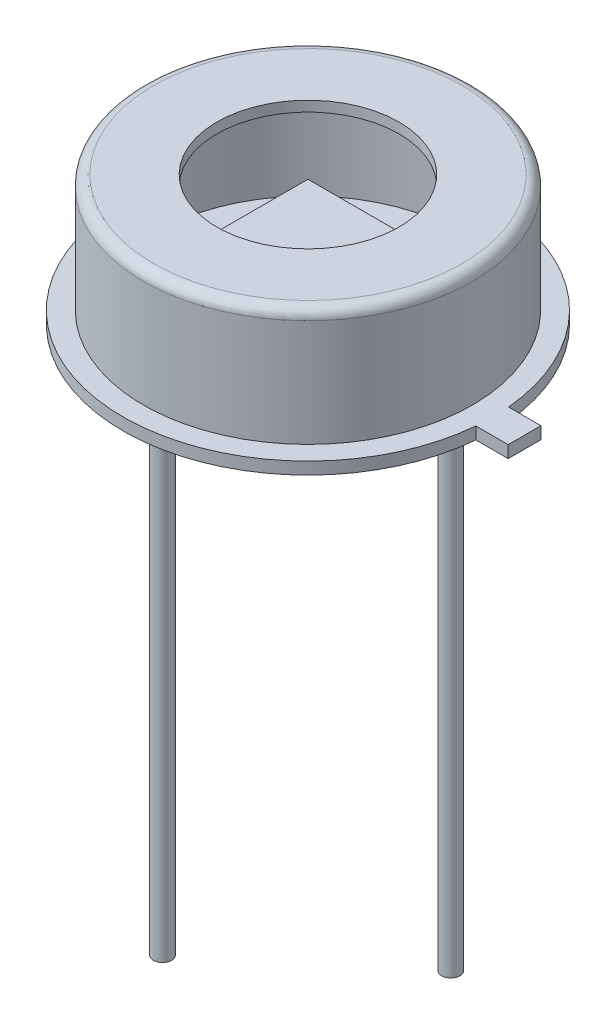
ISO-10303-21;
HEADER;
FILE_DESCRIPTION(('STEP AP214'),'2;1');
FILE_NAME('part.step','',(''),(''),'','','');
FILE_SCHEMA(('AUTOMOTIVE_DESIGN { 1 0 10303 214 1 1 1 1 }'));
ENDSEC;
DATA;
#1=APPLICATION_CONTEXT('core data for automotive mechanical design processes');
#2=APPLICATION_PROTOCOL_DEFINITION('international standard','automotive_design',2000,#1);
#3=PRODUCT_CONTEXT('',#1,'mechanical');
#4=PRODUCT('Part','Part','',(#3));
#5=PRODUCT_RELATED_PRODUCT_CATEGORY('part','',(#4));
#6=PRODUCT_DEFINITION_FORMATION('','',#4);
#7=PRODUCT_DEFINITION_CONTEXT('part definition',#1,'design');
#8=PRODUCT_DEFINITION('design','',#6,#7);
#9=PRODUCT_DEFINITION_SHAPE('','',#8);
#10=(LENGTH_UNIT() NAMED_UNIT(*) SI_UNIT(.MILLI.,.METRE.));
#11=(NAMED_UNIT(*) PLANE_ANGLE_UNIT() SI_UNIT($,.RADIAN.));
#12=(NAMED_UNIT(*) SI_UNIT($,.STERADIAN.) SOLID_ANGLE_UNIT());
#13=UNCERTAINTY_MEASURE_WITH_UNIT(LENGTH_MEASURE(1.E-05),#10,'distance_accuracy_value','');
#14=(GEOMETRIC_REPRESENTATION_CONTEXT(3) GLOBAL_UNCERTAINTY_ASSIGNED_CONTEXT((#13)) GLOBAL_UNIT_ASSIGNED_CONTEXT((#10,
#11,#12)) REPRESENTATION_CONTEXT('',''));
#15=CARTESIAN_POINT('',(0.,0.,0.));
#16=DIRECTION('',(0.,0.,1.));
#17=DIRECTION('',(1.,0.,0.));
#18=AXIS2_PLACEMENT_3D('',#15,#16,#17);
#19=CARTESIAN_POINT('',(-1.25,1.8,-1.25));
#20=DIRECTION('',(0.,-1.,0.));
#21=DIRECTION('',(0.,0.,-1.));
#22=AXIS2_PLACEMENT_3D('',#19,#20,#21);
#23=PLANE('',#22);
#24=DIRECTION('',(0.,0.,-1.));
#25=VECTOR('',#24,1.);
#26=CARTESIAN_POINT('',(-1.25,1.8,1.25));
#27=LINE('',#26,#25);
#28=CARTESIAN_POINT('',(-1.25,1.8,1.25));
#29=VERTEX_POINT('',#28);
#30=CARTESIAN_POINT('',(-1.25,1.8,-1.25));
#31=VERTEX_POINT('',#30);
#32=EDGE_CURVE('E139',#29,#31,#27,.T.);
#33=ORIENTED_EDGE('',*,*,#32,.F.);
#34=DIRECTION('',(-1.,0.,0.));
#35=VECTOR('',#34,1.);
#36=CARTESIAN_POINT('',(-1.25,1.8,1.25));
#37=LINE('',#36,#35);
#38=CARTESIAN_POINT('',(1.25,1.8,1.25));
#39=VERTEX_POINT('',#38);
#40=EDGE_CURVE('E152',#39,#29,#37,.T.);
#41=ORIENTED_EDGE('',*,*,#40,.F.);
#42=DIRECTION('',(0.,0.,1.));
#43=VECTOR('',#42,1.);
#44=CARTESIAN_POINT('',(1.25,1.8,1.25));
#45=LINE('',#44,#43);
#46=CARTESIAN_POINT('',(1.25,1.8,-1.25));
#47=VERTEX_POINT('',#46);
#48=EDGE_CURVE('E160',#47,#39,#45,.T.);
#49=ORIENTED_EDGE('',*,*,#48,.F.);
#50=DIRECTION('',(1.,0.,0.));
#51=VECTOR('',#50,1.);
#52=CARTESIAN_POINT('',(-1.25,1.8,-1.25));
#53=LINE('',#52,#51);
#54=EDGE_CURVE('E142',#31,#47,#53,.T.);
#55=ORIENTED_EDGE('',*,*,#54,.F.);
#56=EDGE_LOOP('',(#33,#41,#49,#55));
#57=FACE_BOUND('',#56,.T.);
#58=DIRECTION('',(0.,0.,1.));
#59=VECTOR('',#58,1.);
#60=CARTESIAN_POINT('',(-1.1,1.8,1.1));
#61=LINE('',#60,#59);
#62=CARTESIAN_POINT('',(-1.1,1.8,-1.1));
#63=VERTEX_POINT('',#62);
#64=CARTESIAN_POINT('',(-1.1,1.8,1.1));
#65=VERTEX_POINT('',#64);
#66=EDGE_CURVE('E138',#63,#65,#61,.T.);
#67=ORIENTED_EDGE('',*,*,#66,.F.);
#68=DIRECTION('',(-1.,0.,0.));
#69=VECTOR('',#68,1.);
#70=CARTESIAN_POINT('',(1.1,1.8,-1.1));
#71=LINE('',#70,#69);
#72=CARTESIAN_POINT('',(1.1,1.8,-1.1));
#73=VERTEX_POINT('',#72);
#74=EDGE_CURVE('E135',#73,#63,#71,.T.);
#75=ORIENTED_EDGE('',*,*,#74,.F.);
#76=DIRECTION('',(0.,0.,-1.));
#77=VECTOR('',#76,1.);
#78=CARTESIAN_POINT('',(1.1,1.8,1.1));
#79=LINE('',#78,#77);
#80=CARTESIAN_POINT('',(1.1,1.8,1.1));
#81=VERTEX_POINT('',#80);
#82=EDGE_CURVE('E73',#81,#73,#79,.T.);
#83=ORIENTED_EDGE('',*,*,#82,.F.);
#84=DIRECTION('',(1.,0.,0.));
#85=VECTOR('',#84,1.);
#86=CARTESIAN_POINT('',(1.1,1.8,1.1));
#87=LINE('',#86,#85);
#88=EDGE_CURVE('E68',#65,#81,#87,.T.);
#89=ORIENTED_EDGE('',*,*,#88,.F.);
#90=EDGE_LOOP('',(#67,#75,#83,#89));
#91=FACE_BOUND('',#90,.T.);
#92=ADVANCED_FACE('F53',(#57,#91),#23,.F.);
#93=CARTESIAN_POINT('',(-1.25,1.75,1.25));
#94=DIRECTION('',(1.,0.,0.));
#95=DIRECTION('',(0.,0.,-1.));
#96=AXIS2_PLACEMENT_3D('',#93,#94,#95);
#97=PLANE('',#96);
#98=ORIENTED_EDGE('',*,*,#32,.T.);
#99=DIRECTION('',(0.,1.,0.));
#100=VECTOR('',#99,1.);
#101=CARTESIAN_POINT('',(-1.25,1.75,-1.25));
#102=LINE('',#101,#100);
#103=CARTESIAN_POINT('',(-1.25,1.75,-1.25));
#104=VERTEX_POINT('',#103);
#105=EDGE_CURVE('E12',#104,#31,#102,.T.);
#106=ORIENTED_EDGE('',*,*,#105,.F.);
#107=DIRECTION('',(0.,0.,-1.));
#108=VECTOR('',#107,1.);
#109=CARTESIAN_POINT('',(-1.25,1.75,1.25));
#110=LINE('',#109,#108);
#111=CARTESIAN_POINT('',(-1.25,1.75,1.25));
#112=VERTEX_POINT('',#111);
#113=EDGE_CURVE('E148',#112,#104,#110,.T.);
#114=ORIENTED_EDGE('',*,*,#113,.F.);
#115=DIRECTION('',(0.,1.,0.));
#116=VECTOR('',#115,1.);
#117=CARTESIAN_POINT('',(-1.25,1.75,1.25));
#118=LINE('',#117,#116);
#119=EDGE_CURVE('E157',#112,#29,#118,.T.);
#120=ORIENTED_EDGE('',*,*,#119,.T.);
#121=EDGE_LOOP('',(#98,#106,#114,#120));
#122=FACE_BOUND('',#121,.T.);
#123=ADVANCED_FACE('F55',(#122),#97,.F.);
#124=CARTESIAN_POINT('',(-1.25,1.75,-1.25));
#125=DIRECTION('',(0.,0.,1.));
#126=DIRECTION('',(1.,0.,0.));
#127=AXIS2_PLACEMENT_3D('',#124,#125,#126);
#128=PLANE('',#127);
#129=ORIENTED_EDGE('',*,*,#54,.T.);
#130=DIRECTION('',(0.,1.,0.));
#131=VECTOR('',#130,1.);
#132=CARTESIAN_POINT('',(1.25,1.75,-1.25));
#133=LINE('',#132,#131);
#134=CARTESIAN_POINT('',(1.25,1.75,-1.25));
#135=VERTEX_POINT('',#134);
#136=EDGE_CURVE('E61',#135,#47,#133,.T.);
#137=ORIENTED_EDGE('',*,*,#136,.F.);
#138=DIRECTION('',(1.,0.,0.));
#139=VECTOR('',#138,1.);
#140=CARTESIAN_POINT('',(-1.25,1.75,-1.25));
#141=LINE('',#140,#139);
#142=EDGE_CURVE('E151',#104,#135,#141,.T.);
#143=ORIENTED_EDGE('',*,*,#142,.F.);
#144=ORIENTED_EDGE('',*,*,#105,.T.);
#145=EDGE_LOOP('',(#129,#137,#143,#144));
#146=FACE_BOUND('',#145,.T.);
#147=ADVANCED_FACE('F187',(#146),#128,.F.);
#148=CARTESIAN_POINT('',(1.25,1.75,1.25));
#149=DIRECTION('',(-1.,0.,0.));
#150=DIRECTION('',(0.,0.,1.));
#151=AXIS2_PLACEMENT_3D('',#148,#149,#150);
#152=PLANE('',#151);
#153=ORIENTED_EDGE('',*,*,#48,.T.);
#154=DIRECTION('',(0.,1.,0.));
#155=VECTOR('',#154,1.);
#156=CARTESIAN_POINT('',(1.25,1.75,1.25));
#157=LINE('',#156,#155);
#158=CARTESIAN_POINT('',(1.25,1.75,1.25));
#159=VERTEX_POINT('',#158);
#160=EDGE_CURVE('E165',#159,#39,#157,.T.);
#161=ORIENTED_EDGE('',*,*,#160,.F.);
#162=DIRECTION('',(0.,0.,1.));
#163=VECTOR('',#162,1.);
#164=CARTESIAN_POINT('',(1.25,1.75,1.25));
#165=LINE('',#164,#163);
#166=EDGE_CURVE('E154',#135,#159,#165,.T.);
#167=ORIENTED_EDGE('',*,*,#166,.F.);
#168=ORIENTED_EDGE('',*,*,#136,.T.);
#169=EDGE_LOOP('',(#153,#161,#167,#168));
#170=FACE_BOUND('',#169,.T.);
#171=ADVANCED_FACE('F172',(#170),#152,.F.);
#172=CARTESIAN_POINT('',(-1.25,1.75,1.25));
#173=DIRECTION('',(0.,0.,-1.));
#174=DIRECTION('',(-1.,0.,0.));
#175=AXIS2_PLACEMENT_3D('',#172,#173,#174);
#176=PLANE('',#175);
#177=ORIENTED_EDGE('',*,*,#40,.T.);
#178=ORIENTED_EDGE('',*,*,#119,.F.);
#179=DIRECTION('',(-1.,0.,0.));
#180=VECTOR('',#179,1.);
#181=CARTESIAN_POINT('',(-1.25,1.75,1.25));
#182=LINE('',#181,#180);
#183=EDGE_CURVE('E156',#159,#112,#182,.T.);
#184=ORIENTED_EDGE('',*,*,#183,.F.);
#185=ORIENTED_EDGE('',*,*,#160,.T.);
#186=EDGE_LOOP('',(#177,#178,#184,#185));
#187=FACE_BOUND('',#186,.T.);
#188=ADVANCED_FACE('F180',(#187),#176,.F.);
#189=CARTESIAN_POINT('',(-1.25,1.75,-1.25));
#190=DIRECTION('',(0.,-1.,0.));
#191=DIRECTION('',(0.,0.,-1.));
#192=AXIS2_PLACEMENT_3D('',#189,#190,#191);
#193=PLANE('',#192);
#194=ORIENTED_EDGE('',*,*,#113,.T.);
#195=ORIENTED_EDGE('',*,*,#142,.T.);
#196=ORIENTED_EDGE('',*,*,#166,.T.);
#197=ORIENTED_EDGE('',*,*,#183,.T.);
#198=EDGE_LOOP('',(#194,#195,#196,#197));
#199=FACE_BOUND('',#198,.T.);
#200=ADVANCED_FACE('F186',(#199),#193,.T.);
#201=CARTESIAN_POINT('',(-1.1,2.,1.1));
#202=DIRECTION('',(1.,0.,0.));
#203=DIRECTION('',(0.,0.,-1.));
#204=AXIS2_PLACEMENT_3D('',#201,#202,#203);
#205=PLANE('',#204);
#206=ORIENTED_EDGE('',*,*,#66,.T.);
#207=DIRECTION('',(0.,-1.,0.));
#208=VECTOR('',#207,1.);
#209=CARTESIAN_POINT('',(-1.1,2.,1.1));
#210=LINE('',#209,#208);
#211=CARTESIAN_POINT('',(-1.1,2.,1.1));
#212=VERTEX_POINT('',#211);
#213=EDGE_CURVE('E119',#212,#65,#210,.T.);
#214=ORIENTED_EDGE('',*,*,#213,.F.);
#215=DIRECTION('',(0.,0.,1.));
#216=VECTOR('',#215,1.);
#217=CARTESIAN_POINT('',(-1.1,2.,1.1));
#218=LINE('',#217,#216);
#219=CARTESIAN_POINT('',(-1.1,2.,-1.1));
#220=VERTEX_POINT('',#219);
#221=EDGE_CURVE('E126',#220,#212,#218,.T.);
#222=ORIENTED_EDGE('',*,*,#221,.F.);
#223=DIRECTION('',(0.,-1.,0.));
#224=VECTOR('',#223,1.);
#225=CARTESIAN_POINT('',(-1.1,2.,-1.1));
#226=LINE('',#225,#224);
#227=EDGE_CURVE('E282',#220,#63,#226,.T.);
#228=ORIENTED_EDGE('',*,*,#227,.T.);
#229=EDGE_LOOP('',(#206,#214,#222,#228));
#230=FACE_BOUND('',#229,.T.);
#231=ADVANCED_FACE('F137',(#230),#205,.F.);
#232=CARTESIAN_POINT('',(1.1,2.,1.1));
#233=DIRECTION('',(0.,0.,-1.));
#234=DIRECTION('',(-1.,0.,0.));
#235=AXIS2_PLACEMENT_3D('',#232,#233,#234);
#236=PLANE('',#235);
#237=ORIENTED_EDGE('',*,*,#88,.T.);
#238=DIRECTION('',(0.,-1.,0.));
#239=VECTOR('',#238,1.);
#240=CARTESIAN_POINT('',(1.1,2.,1.1));
#241=LINE('',#240,#239);
#242=CARTESIAN_POINT('',(1.1,2.,1.1));
#243=VERTEX_POINT('',#242);
#244=EDGE_CURVE('E122',#243,#81,#241,.T.);
#245=ORIENTED_EDGE('',*,*,#244,.F.);
#246=DIRECTION('',(1.,0.,0.));
#247=VECTOR('',#246,1.);
#248=CARTESIAN_POINT('',(1.1,2.,1.1));
#249=LINE('',#248,#247);
#250=EDGE_CURVE('E115',#212,#243,#249,.T.);
#251=ORIENTED_EDGE('',*,*,#250,.F.);
#252=ORIENTED_EDGE('',*,*,#213,.T.);
#253=EDGE_LOOP('',(#237,#245,#251,#252));
#254=FACE_BOUND('',#253,.T.);
#255=ADVANCED_FACE('F117',(#254),#236,.F.);
#256=CARTESIAN_POINT('',(1.1,2.,1.1));
#257=DIRECTION('',(-1.,0.,0.));
#258=DIRECTION('',(0.,0.,1.));
#259=AXIS2_PLACEMENT_3D('',#256,#257,#258);
#260=PLANE('',#259);
#261=ORIENTED_EDGE('',*,*,#82,.T.);
#262=DIRECTION('',(0.,-1.,0.));
#263=VECTOR('',#262,1.);
#264=CARTESIAN_POINT('',(1.1,2.,-1.1));
#265=LINE('',#264,#263);
#266=CARTESIAN_POINT('',(1.1,2.,-1.1));
#267=VERTEX_POINT('',#266);
#268=EDGE_CURVE('E144',#267,#73,#265,.T.);
#269=ORIENTED_EDGE('',*,*,#268,.F.);
#270=DIRECTION('',(0.,0.,-1.));
#271=VECTOR('',#270,1.);
#272=CARTESIAN_POINT('',(1.1,2.,1.1));
#273=LINE('',#272,#271);
#274=EDGE_CURVE('E125',#243,#267,#273,.T.);
#275=ORIENTED_EDGE('',*,*,#274,.F.);
#276=ORIENTED_EDGE('',*,*,#244,.T.);
#277=EDGE_LOOP('',(#261,#269,#275,#276));
#278=FACE_BOUND('',#277,.T.);
#279=ADVANCED_FACE('F211',(#278),#260,.F.);
#280=CARTESIAN_POINT('',(1.1,2.,-1.1));
#281=DIRECTION('',(0.,0.,1.));
#282=DIRECTION('',(1.,0.,0.));
#283=AXIS2_PLACEMENT_3D('',#280,#281,#282);
#284=PLANE('',#283);
#285=ORIENTED_EDGE('',*,*,#74,.T.);
#286=ORIENTED_EDGE('',*,*,#227,.F.);
#287=DIRECTION('',(-1.,0.,0.));
#288=VECTOR('',#287,1.);
#289=CARTESIAN_POINT('',(1.1,2.,-1.1));
#290=LINE('',#289,#288);
#291=EDGE_CURVE('E131',#267,#220,#290,.T.);
#292=ORIENTED_EDGE('',*,*,#291,.F.);
#293=ORIENTED_EDGE('',*,*,#268,.T.);
#294=EDGE_LOOP('',(#285,#286,#292,#293));
#295=FACE_BOUND('',#294,.T.);
#296=ADVANCED_FACE('F216',(#295),#284,.F.);
#297=CARTESIAN_POINT('',(-1.1,2.,-1.1));
#298=DIRECTION('',(0.,1.,0.));
#299=DIRECTION('',(0.,0.,1.));
#300=AXIS2_PLACEMENT_3D('',#297,#298,#299);
#301=PLANE('',#300);
#302=ORIENTED_EDGE('',*,*,#221,.T.);
#303=ORIENTED_EDGE('',*,*,#250,.T.);
#304=ORIENTED_EDGE('',*,*,#274,.T.);
#305=ORIENTED_EDGE('',*,*,#291,.T.);
#306=EDGE_LOOP('',(#302,#303,#304,#305));
#307=FACE_BOUND('',#306,.T.);
#308=ADVANCED_FACE('F129',(#307),#301,.T.);
#309=CLOSED_SHELL('',(#92,#123,#147,#171,#188,#200,#231,#255,#279,#296,#308));
#310=MANIFOLD_SOLID_BREP('B2',#309);
#311=CARTESIAN_POINT('',(4.57,0.,0.));
#312=DIRECTION('',(0.,1.,0.));
#313=DIRECTION('',(0.,0.,1.));
#314=AXIS2_PLACEMENT_3D('',#311,#312,#313);
#315=PLANE('',#314);
#316=CARTESIAN_POINT('',(2.09605122421386,0.,-1.43463210108781));
#317=DIRECTION('',(0.,1.,0.));
#318=DIRECTION('',(0.,0.,1.));
#319=AXIS2_PLACEMENT_3D('',#316,#317,#318);
#320=CIRCLE('',#319,0.225000000000001);
#321=CARTESIAN_POINT('',(2.09605122421386,0.,-1.20963210108781));
#322=VERTEX_POINT('',#321);
#323=EDGE_CURVE('E308',#322,#322,#320,.F.);
#324=ORIENTED_EDGE('',*,*,#323,.F.);
#325=EDGE_LOOP('',(#324));
#326=FACE_BOUND('',#325,.T.);
#327=CARTESIAN_POINT('',(0.,0.,0.));
#328=DIRECTION('',(0.,-1.,0.));
#329=DIRECTION('',(0.,0.,-1.));
#330=AXIS2_PLACEMENT_3D('',#327,#328,#329);
#331=CIRCLE('',#330,4.57);
#332=CARTESIAN_POINT('',(4.55201878291379,0.,0.405000000000049));
#333=VERTEX_POINT('',#332);
#334=CARTESIAN_POINT('',(4.5520187829138,0.,-0.404999999999951));
#335=VERTEX_POINT('',#334);
#336=EDGE_CURVE('E315',#333,#335,#331,.T.);
#337=ORIENTED_EDGE('',*,*,#336,.T.);
#338=DIRECTION('',(-1.,0.,0.));
#339=VECTOR('',#338,1.);
#340=CARTESIAN_POINT('',(0.,0.,-0.405));
#341=LINE('',#340,#339);
#342=CARTESIAN_POINT('',(5.3520187829138,0.,-0.404999999999943));
#343=VERTEX_POINT('',#342);
#344=EDGE_CURVE('E365',#343,#335,#341,.T.);
#345=ORIENTED_EDGE('',*,*,#344,.F.);
#346=DIRECTION('',(0.,0.,1.));
#347=VECTOR('',#346,1.);
#348=CARTESIAN_POINT('',(5.3520187829138,0.,0.));
#349=LINE('',#348,#347);
#350=CARTESIAN_POINT('',(5.35201878291379,0.,0.405000000000057));
#351=VERTEX_POINT('',#350);
#352=EDGE_CURVE('E359',#343,#351,#349,.T.);
#353=ORIENTED_EDGE('',*,*,#352,.T.);
#354=DIRECTION('',(-1.,0.,0.));
#355=VECTOR('',#354,1.);
#356=CARTESIAN_POINT('',(0.,0.,0.405));
#357=LINE('',#356,#355);
#358=EDGE_CURVE('E357',#351,#333,#357,.T.);
#359=ORIENTED_EDGE('',*,*,#358,.T.);
#360=EDGE_LOOP('',(#337,#345,#353,#359));
#361=FACE_BOUND('',#360,.T.);
#362=CARTESIAN_POINT('',(-1.79605122421384,0.,1.79605122421382));
#363=DIRECTION('',(0.,1.,0.));
#364=DIRECTION('',(0.,0.,1.));
#365=AXIS2_PLACEMENT_3D('',#362,#363,#364);
#366=CIRCLE('',#365,0.225000000000001);
#367=CARTESIAN_POINT('',(-1.79605122421384,0.,2.02105122421382));
#368=VERTEX_POINT('',#367);
#369=EDGE_CURVE('E51',#368,#368,#366,.F.);
#370=ORIENTED_EDGE('',*,*,#369,.F.);
#371=EDGE_LOOP('',(#370));
#372=FACE_BOUND('',#371,.T.);
#373=ADVANCED_FACE('F300',(#326,#361,#372),#315,.F.);
#374=CARTESIAN_POINT('',(3.811,3.2,0.));
#375=DIRECTION('',(0.,1.,0.));
#376=DIRECTION('',(0.,0.,1.));
#377=AXIS2_PLACEMENT_3D('',#374,#375,#376);
#378=PLANE('',#377);
#379=CARTESIAN_POINT('',(0.,3.2,0.));
#380=DIRECTION('',(0.,-1.,0.));
#381=DIRECTION('',(0.,0.,-1.));
#382=AXIS2_PLACEMENT_3D('',#379,#380,#381);
#383=CIRCLE('',#382,2.25);
#384=CARTESIAN_POINT('',(0.,3.2,-2.25));
#385=VERTEX_POINT('',#384);
#386=EDGE_CURVE('E390',#385,#385,#383,.T.);
#387=ORIENTED_EDGE('',*,*,#386,.T.);
#388=EDGE_LOOP('',(#387));
#389=FACE_BOUND('',#388,.T.);
#390=CARTESIAN_POINT('',(0.,3.2,0.));
#391=DIRECTION('',(0.,-1.,0.));
#392=DIRECTION('',(0.,0.,-1.));
#393=AXIS2_PLACEMENT_3D('',#390,#391,#392);
#394=CIRCLE('',#393,3.811);
#395=CARTESIAN_POINT('',(0.,3.2,-3.811));
#396=VERTEX_POINT('',#395);
#397=EDGE_CURVE('E375',#396,#396,#394,.T.);
#398=ORIENTED_EDGE('',*,*,#397,.F.);
#399=EDGE_LOOP('',(#398));
#400=FACE_BOUND('',#399,.T.);
#401=ADVANCED_FACE('F302',(#389,#400),#378,.T.);
#402=CARTESIAN_POINT('',(0.,0.,0.));
#403=DIRECTION('',(0.,-1.,0.));
#404=DIRECTION('',(0.,0.,-1.));
#405=AXIS2_PLACEMENT_3D('',#402,#403,#404);
#406=CYLINDRICAL_SURFACE('',#405,2.25);
#407=ORIENTED_EDGE('',*,*,#386,.F.);
#408=EDGE_LOOP('',(#407));
#409=FACE_BOUND('',#408,.T.);
#410=CARTESIAN_POINT('',(0.,2.946,0.));
#411=DIRECTION('',(0.,-1.,0.));
#412=DIRECTION('',(0.,0.,-1.));
#413=AXIS2_PLACEMENT_3D('',#410,#411,#412);
#414=CIRCLE('',#413,2.25);
#415=CARTESIAN_POINT('',(0.,2.946,-2.25));
#416=VERTEX_POINT('',#415);
#417=EDGE_CURVE('E387',#416,#416,#414,.T.);
#418=ORIENTED_EDGE('',*,*,#417,.T.);
#419=EDGE_LOOP('',(#418));
#420=FACE_BOUND('',#419,.T.);
#421=ADVANCED_FACE('F457',(#409,#420),#406,.F.);
#422=CARTESIAN_POINT('',(3.811,2.946,0.));
#423=DIRECTION('',(0.,1.,0.));
#424=DIRECTION('',(0.,0.,1.));
#425=AXIS2_PLACEMENT_3D('',#422,#423,#424);
#426=PLANE('',#425);
#427=ORIENTED_EDGE('',*,*,#417,.F.);
#428=EDGE_LOOP('',(#427));
#429=FACE_BOUND('',#428,.T.);
#430=CARTESIAN_POINT('',(0.,2.946,0.));
#431=DIRECTION('',(0.,-1.,0.));
#432=DIRECTION('',(0.,0.,-1.));
#433=AXIS2_PLACEMENT_3D('',#430,#431,#432);
#434=CIRCLE('',#433,3.811);
#435=CARTESIAN_POINT('',(0.,2.946,-3.811));
#436=VERTEX_POINT('',#435);
#437=EDGE_CURVE('E384',#436,#436,#434,.T.);
#438=ORIENTED_EDGE('',*,*,#437,.T.);
#439=EDGE_LOOP('',(#438));
#440=FACE_BOUND('',#439,.T.);
#441=ADVANCED_FACE('F454',(#429,#440),#426,.F.);
#442=CARTESIAN_POINT('',(0.,0.,0.));
#443=DIRECTION('',(0.,-1.,0.));
#444=DIRECTION('',(0.,0.,-1.));
#445=AXIS2_PLACEMENT_3D('',#442,#443,#444);
#446=CYLINDRICAL_SURFACE('',#445,3.811);
#447=ORIENTED_EDGE('',*,*,#437,.F.);
#448=EDGE_LOOP('',(#447));
#449=FACE_BOUND('',#448,.T.);
#450=CARTESIAN_POINT('',(0.,0.0459999999999999,0.));
#451=DIRECTION('',(0.,1.,0.));
#452=DIRECTION('',(0.,0.,1.));
#453=AXIS2_PLACEMENT_3D('',#450,#451,#452);
#454=CIRCLE('',#453,3.811);
#455=CARTESIAN_POINT('',(0.,0.0459999999999999,3.811));
#456=VERTEX_POINT('',#455);
#457=EDGE_CURVE('E372',#456,#456,#454,.F.);
#458=ORIENTED_EDGE('',*,*,#457,.T.);
#459=EDGE_LOOP('',(#458));
#460=FACE_BOUND('',#459,.T.);
#461=ADVANCED_FACE('F450',(#449,#460),#446,.F.);
#462=CARTESIAN_POINT('',(0.,0.,0.));
#463=DIRECTION('',(0.,-1.,0.));
#464=DIRECTION('',(0.,0.,-1.));
#465=AXIS2_PLACEMENT_3D('',#462,#463,#464);
#466=CYLINDRICAL_SURFACE('',#465,4.57);
#467=DIRECTION('',(0.,-1.,0.));
#468=VECTOR('',#467,1.);
#469=CARTESIAN_POINT('',(4.55201878291379,1.43846387733649,0.405000000000049));
#470=LINE('',#469,#468);
#471=CARTESIAN_POINT('',(4.55201878291379,0.3,0.405000000000049));
#472=VERTEX_POINT('',#471);
#473=EDGE_CURVE('E348',#472,#333,#470,.T.);
#474=ORIENTED_EDGE('',*,*,#473,.F.);
#475=CARTESIAN_POINT('',(0.,0.3,0.));
#476=DIRECTION('',(0.,-1.,0.));
#477=DIRECTION('',(0.,0.,-1.));
#478=AXIS2_PLACEMENT_3D('',#475,#476,#477);
#479=CIRCLE('',#478,4.57);
#480=CARTESIAN_POINT('',(4.5520187829138,0.3,-0.404999999999951));
#481=VERTEX_POINT('',#480);
#482=EDGE_CURVE('E339',#472,#481,#479,.T.);
#483=ORIENTED_EDGE('',*,*,#482,.T.);
#484=DIRECTION('',(0.,-1.,0.));
#485=VECTOR('',#484,1.);
#486=CARTESIAN_POINT('',(4.5520187829138,1.43846387733649,-0.404999999999951));
#487=LINE('',#486,#485);
#488=EDGE_CURVE('E320',#481,#335,#487,.T.);
#489=ORIENTED_EDGE('',*,*,#488,.T.);
#490=ORIENTED_EDGE('',*,*,#336,.F.);
#491=EDGE_LOOP('',(#474,#483,#489,#490));
#492=FACE_BOUND('',#491,.T.);
#493=ADVANCED_FACE('F349',(#492),#466,.T.);
#494=CARTESIAN_POINT('',(4.57,0.3,0.));
#495=DIRECTION('',(0.,1.,0.));
#496=DIRECTION('',(0.,0.,1.));
#497=AXIS2_PLACEMENT_3D('',#494,#495,#496);
#498=PLANE('',#497);
#499=CARTESIAN_POINT('',(0.,0.3,0.));
#500=DIRECTION('',(0.,-1.,0.));
#501=DIRECTION('',(0.,0.,-1.));
#502=AXIS2_PLACEMENT_3D('',#499,#500,#501);
#503=CIRCLE('',#502,4.065);
#504=CARTESIAN_POINT('',(0.,0.3,-4.065));
#505=VERTEX_POINT('',#504);
#506=EDGE_CURVE('E346',#505,#505,#503,.T.);
#507=ORIENTED_EDGE('',*,*,#506,.T.);
#508=EDGE_LOOP('',(#507));
#509=FACE_BOUND('',#508,.T.);
#510=ORIENTED_EDGE('',*,*,#482,.F.);
#511=DIRECTION('',(-1.,0.,0.));
#512=VECTOR('',#511,1.);
#513=CARTESIAN_POINT('',(0.,0.3,0.405));
#514=LINE('',#513,#512);
#515=CARTESIAN_POINT('',(5.35201878291379,0.3,0.405000000000057));
#516=VERTEX_POINT('',#515);
#517=EDGE_CURVE('E342',#516,#472,#514,.T.);
#518=ORIENTED_EDGE('',*,*,#517,.F.);
#519=DIRECTION('',(0.,0.,1.));
#520=VECTOR('',#519,1.);
#521=CARTESIAN_POINT('',(5.3520187829138,0.3,0.));
#522=LINE('',#521,#520);
#523=CARTESIAN_POINT('',(5.3520187829138,0.3,-0.404999999999943));
#524=VERTEX_POINT('',#523);
#525=EDGE_CURVE('E363',#524,#516,#522,.T.);
#526=ORIENTED_EDGE('',*,*,#525,.F.);
#527=DIRECTION('',(-1.,0.,0.));
#528=VECTOR('',#527,1.);
#529=CARTESIAN_POINT('',(0.,0.3,-0.405));
#530=LINE('',#529,#528);
#531=EDGE_CURVE('E345',#524,#481,#530,.T.);
#532=ORIENTED_EDGE('',*,*,#531,.T.);
#533=EDGE_LOOP('',(#510,#518,#526,#532));
#534=FACE_BOUND('',#533,.T.);
#535=ADVANCED_FACE('F340',(#509,#534),#498,.T.);
#536=CARTESIAN_POINT('',(0.,0.,0.));
#537=DIRECTION('',(0.,-1.,0.));
#538=DIRECTION('',(0.,0.,-1.));
#539=AXIS2_PLACEMENT_3D('',#536,#537,#538);
#540=CYLINDRICAL_SURFACE('',#539,4.065);
#541=CARTESIAN_POINT('',(0.,2.946,0.));
#542=DIRECTION('',(0.,-1.,0.));
#543=DIRECTION('',(0.,0.,-1.));
#544=AXIS2_PLACEMENT_3D('',#541,#542,#543);
#545=CIRCLE('',#544,4.065);
#546=CARTESIAN_POINT('',(0.,2.946,-4.065));
#547=VERTEX_POINT('',#546);
#548=EDGE_CURVE('E378',#547,#547,#545,.T.);
#549=ORIENTED_EDGE('',*,*,#548,.T.);
#550=EDGE_LOOP('',(#549));
#551=FACE_BOUND('',#550,.T.);
#552=ORIENTED_EDGE('',*,*,#506,.F.);
#553=EDGE_LOOP('',(#552));
#554=FACE_BOUND('',#553,.T.);
#555=ADVANCED_FACE('F441',(#551,#554),#540,.T.);
#556=CARTESIAN_POINT('',(0.,2.946,0.));
#557=DIRECTION('',(0.,-1.,0.));
#558=DIRECTION('',(0.,0.,-1.));
#559=AXIS2_PLACEMENT_3D('',#556,#557,#558);
#560=TOROIDAL_SURFACE('',#559,3.811,0.254);
#561=ORIENTED_EDGE('',*,*,#397,.T.);
#562=EDGE_LOOP('',(#561));
#563=FACE_BOUND('',#562,.T.);
#564=ORIENTED_EDGE('',*,*,#548,.F.);
#565=EDGE_LOOP('',(#564));
#566=FACE_BOUND('',#565,.T.);
#567=ADVANCED_FACE('F437',(#563,#566),#560,.T.);
#568=CARTESIAN_POINT('',(4.57,0.0459999999999999,0.));
#569=DIRECTION('',(0.,1.,0.));
#570=DIRECTION('',(0.,0.,1.));
#571=AXIS2_PLACEMENT_3D('',#568,#569,#570);
#572=PLANE('',#571);
#573=ORIENTED_EDGE('',*,*,#457,.F.);
#574=EDGE_LOOP('',(#573));
#575=FACE_BOUND('',#574,.T.);
#576=ADVANCED_FACE('F434',(#575),#572,.T.);
#577=CARTESIAN_POINT('',(0.,1.43846387733649,0.405));
#578=DIRECTION('',(0.,0.,1.));
#579=DIRECTION('',(1.,0.,0.));
#580=AXIS2_PLACEMENT_3D('',#577,#578,#579);
#581=PLANE('',#580);
#582=DIRECTION('',(0.,-1.,0.));
#583=VECTOR('',#582,1.);
#584=CARTESIAN_POINT('',(5.35201878291379,1.43846387733649,0.405000000000057));
#585=LINE('',#584,#583);
#586=EDGE_CURVE('E356',#516,#351,#585,.T.);
#587=ORIENTED_EDGE('',*,*,#586,.F.);
#588=ORIENTED_EDGE('',*,*,#517,.T.);
#589=ORIENTED_EDGE('',*,*,#473,.T.);
#590=ORIENTED_EDGE('',*,*,#358,.F.);
#591=EDGE_LOOP('',(#587,#588,#589,#590));
#592=FACE_BOUND('',#591,.T.);
#593=ADVANCED_FACE('F355',(#592),#581,.T.);
#594=CARTESIAN_POINT('',(0.,1.43846387733649,-0.405));
#595=DIRECTION('',(0.,0.,1.));
#596=DIRECTION('',(1.,0.,0.));
#597=AXIS2_PLACEMENT_3D('',#594,#595,#596);
#598=PLANE('',#597);
#599=ORIENTED_EDGE('',*,*,#531,.F.);
#600=DIRECTION('',(0.,-1.,0.));
#601=VECTOR('',#600,1.);
#602=CARTESIAN_POINT('',(5.3520187829138,1.43846387733649,-0.404999999999943));
#603=LINE('',#602,#601);
#604=EDGE_CURVE('E368',#524,#343,#603,.T.);
#605=ORIENTED_EDGE('',*,*,#604,.T.);
#606=ORIENTED_EDGE('',*,*,#344,.T.);
#607=ORIENTED_EDGE('',*,*,#488,.F.);
#608=EDGE_LOOP('',(#599,#605,#606,#607));
#609=FACE_BOUND('',#608,.T.);
#610=ADVANCED_FACE('F427',(#609),#598,.F.);
#611=CARTESIAN_POINT('',(5.3520187829138,1.43846387733649,0.));
#612=DIRECTION('',(1.,0.,0.));
#613=DIRECTION('',(0.,0.,-1.));
#614=AXIS2_PLACEMENT_3D('',#611,#612,#613);
#615=PLANE('',#614);
#616=ORIENTED_EDGE('',*,*,#604,.F.);
#617=ORIENTED_EDGE('',*,*,#525,.T.);
#618=ORIENTED_EDGE('',*,*,#586,.T.);
#619=ORIENTED_EDGE('',*,*,#352,.F.);
#620=EDGE_LOOP('',(#616,#617,#618,#619));
#621=FACE_BOUND('',#620,.T.);
#622=ADVANCED_FACE('F423',(#621),#615,.T.);
#623=CARTESIAN_POINT('',(2.09605122421386,-13.5,-1.43463210108781));
#624=DIRECTION('',(0.,1.,0.));
#625=DIRECTION('',(0.,0.,1.));
#626=AXIS2_PLACEMENT_3D('',#623,#624,#625);
#627=CYLINDRICAL_SURFACE('',#626,0.225000000000001);
#628=CARTESIAN_POINT('',(2.09605122421386,-13.5,-1.43463210108781));
#629=DIRECTION('',(0.,-1.,0.));
#630=DIRECTION('',(0.,0.,1.));
#631=AXIS2_PLACEMENT_3D('',#628,#629,#630);
#632=CIRCLE('',#631,0.225000000000001);
#633=CARTESIAN_POINT('',(2.09605122421386,-13.5,-1.20963210108781));
#634=VERTEX_POINT('',#633);
#635=EDGE_CURVE('E367',#634,#634,#632,.T.);
#636=ORIENTED_EDGE('',*,*,#635,.F.);
#637=EDGE_LOOP('',(#636));
#638=FACE_BOUND('',#637,.T.);
#639=ORIENTED_EDGE('',*,*,#323,.T.);
#640=EDGE_LOOP('',(#639));
#641=FACE_BOUND('',#640,.T.);
#642=ADVANCED_FACE('F395',(#638,#641),#627,.T.);
#643=CARTESIAN_POINT('',(2.09605122421386,-13.5,-1.43463210108781));
#644=DIRECTION('',(0.,1.,0.));
#645=DIRECTION('',(0.,0.,1.));
#646=AXIS2_PLACEMENT_3D('',#643,#644,#645);
#647=PLANE('',#646);
#648=ORIENTED_EDGE('',*,*,#635,.T.);
#649=EDGE_LOOP('',(#648));
#650=FACE_BOUND('',#649,.T.);
#651=ADVANCED_FACE('F408',(#650),#647,.F.);
#652=CARTESIAN_POINT('',(-1.79605122421384,-13.5,1.79605122421382));
#653=DIRECTION('',(0.,1.,0.));
#654=DIRECTION('',(0.,0.,1.));
#655=AXIS2_PLACEMENT_3D('',#652,#653,#654);
#656=CYLINDRICAL_SURFACE('',#655,0.225000000000001);
#657=CARTESIAN_POINT('',(-1.79605122421384,-13.5,1.79605122421382));
#658=DIRECTION('',(0.,-1.,0.));
#659=DIRECTION('',(0.,0.,-1.));
#660=AXIS2_PLACEMENT_3D('',#657,#658,#659);
#661=CIRCLE('',#660,0.225000000000001);
#662=CARTESIAN_POINT('',(-1.79605122421384,-13.5,1.57105122421382));
#663=VERTEX_POINT('',#662);
#664=EDGE_CURVE('E597',#663,#663,#661,.T.);
#665=ORIENTED_EDGE('',*,*,#664,.F.);
#666=EDGE_LOOP('',(#665));
#667=FACE_BOUND('',#666,.T.);
#668=ORIENTED_EDGE('',*,*,#369,.T.);
#669=EDGE_LOOP('',(#668));
#670=FACE_BOUND('',#669,.T.);
#671=ADVANCED_FACE('F405',(#667,#670),#656,.T.);
#672=CARTESIAN_POINT('',(-1.79605122421384,-13.5,1.79605122421382));
#673=DIRECTION('',(0.,-1.,0.));
#674=DIRECTION('',(0.,0.,-1.));
#675=AXIS2_PLACEMENT_3D('',#672,#673,#674);
#676=PLANE('',#675);
#677=ORIENTED_EDGE('',*,*,#664,.T.);
#678=EDGE_LOOP('',(#677));
#679=FACE_BOUND('',#678,.T.);
#680=ADVANCED_FACE('F407',(#679),#676,.T.);
#681=CLOSED_SHELL('',(#373,#401,#421,#441,#461,#493,#535,#555,#567,#576,#593,#610,#622,#642,
#651,#671,#680));
#682=MANIFOLD_SOLID_BREP('B6',#681);
#683=ADVANCED_BREP_SHAPE_REPRESENTATION('',(#18,#310,#682),#14);
#684=SHAPE_DEFINITION_REPRESENTATION(#9,#683);
ENDSEC;
END-ISO-10303-21;
